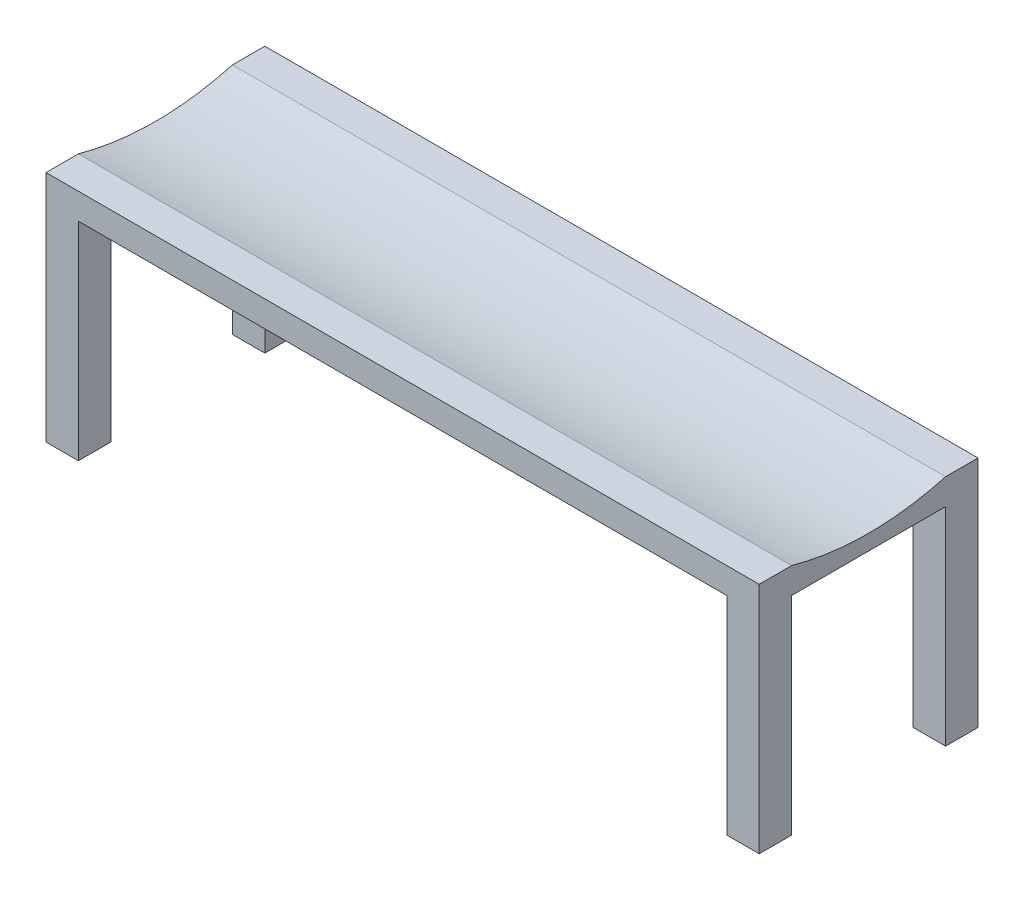
ISO-10303-21;
HEADER;
FILE_DESCRIPTION(('STEP AP214'),'2;1');
FILE_NAME('part.step','',(''),(''),'','','');
FILE_SCHEMA(('AUTOMOTIVE_DESIGN { 1 0 10303 214 1 1 1 1 }'));
ENDSEC;
DATA;
#1=APPLICATION_CONTEXT('core data for automotive mechanical design processes');
#2=APPLICATION_PROTOCOL_DEFINITION('international standard','automotive_design',2000,#1);
#3=PRODUCT_CONTEXT('',#1,'mechanical');
#4=PRODUCT('Part','Part','',(#3));
#5=PRODUCT_RELATED_PRODUCT_CATEGORY('part','',(#4));
#6=PRODUCT_DEFINITION_FORMATION('','',#4);
#7=PRODUCT_DEFINITION_CONTEXT('part definition',#1,'design');
#8=PRODUCT_DEFINITION('design','',#6,#7);
#9=PRODUCT_DEFINITION_SHAPE('','',#8);
#10=(LENGTH_UNIT() NAMED_UNIT(*) SI_UNIT(.MILLI.,.METRE.));
#11=(NAMED_UNIT(*) PLANE_ANGLE_UNIT() SI_UNIT($,.RADIAN.));
#12=(NAMED_UNIT(*) SI_UNIT($,.STERADIAN.) SOLID_ANGLE_UNIT());
#13=UNCERTAINTY_MEASURE_WITH_UNIT(LENGTH_MEASURE(1.E-05),#10,'distance_accuracy_value','');
#14=(GEOMETRIC_REPRESENTATION_CONTEXT(3) GLOBAL_UNCERTAINTY_ASSIGNED_CONTEXT((#13)) GLOBAL_UNIT_ASSIGNED_CONTEXT((#10,
#11,#12)) REPRESENTATION_CONTEXT('',''));
#15=CARTESIAN_POINT('',(0.,0.,0.));
#16=DIRECTION('',(0.,0.,1.));
#17=DIRECTION('',(1.,0.,0.));
#18=AXIS2_PLACEMENT_3D('',#15,#16,#17);
#19=CARTESIAN_POINT('',(162.387965446348,45.72,-6.86400747031921));
#20=DIRECTION('',(-1.,0.,0.));
#21=DIRECTION('',(0.,0.,1.));
#22=AXIS2_PLACEMENT_3D('',#19,#20,#21);
#23=PLANE('',#22);
#24=CARTESIAN_POINT('',(162.387965446348,45.72,-43.3765074703192));
#25=CARTESIAN_POINT('',(162.387965446348,41.5809779899401,-28.2952574703192));
#26=CARTESIAN_POINT('',(162.387965446348,45.72,-13.2140074703192));
#27=B_SPLINE_CURVE_WITH_KNOTS('',2,(#24,#25,#26),.UNSPECIFIED.,.F.,.F.,(3,3),(0.,1.),.UNSPECIFIED.);
#28=CARTESIAN_POINT('',(162.387965446348,45.72,-13.2140074703192));
#29=VERTEX_POINT('',#28);
#30=CARTESIAN_POINT('',(162.387965446348,45.72,-43.3765074703192));
#31=VERTEX_POINT('',#30);
#32=EDGE_CURVE('E53',#29,#31,#27,.F.);
#33=ORIENTED_EDGE('',*,*,#32,.F.);
#34=DIRECTION('',(0.,0.,-1.));
#35=VECTOR('',#34,1.);
#36=CARTESIAN_POINT('',(162.387965446348,45.72,-6.86400747031921));
#37=LINE('',#36,#35);
#38=CARTESIAN_POINT('',(162.387965446348,45.72,-6.86400747031921));
#39=VERTEX_POINT('',#38);
#40=EDGE_CURVE('E191',#39,#29,#37,.T.);
#41=ORIENTED_EDGE('',*,*,#40,.F.);
#42=DIRECTION('',(0.,-1.,0.));
#43=VECTOR('',#42,1.);
#44=CARTESIAN_POINT('',(162.387965446348,45.72,-6.86400747031921));
#45=LINE('',#44,#43);
#46=CARTESIAN_POINT('',(162.387965446348,0.,-6.86400747031921));
#47=VERTEX_POINT('',#46);
#48=EDGE_CURVE('E46',#39,#47,#45,.T.);
#49=ORIENTED_EDGE('',*,*,#48,.T.);
#50=DIRECTION('',(0.,0.,-1.));
#51=VECTOR('',#50,1.);
#52=CARTESIAN_POINT('',(162.387965446348,0.,-6.86400747031921));
#53=LINE('',#52,#51);
#54=CARTESIAN_POINT('',(162.387965446348,0.,-13.2140074703192));
#55=VERTEX_POINT('',#54);
#56=EDGE_CURVE('E205',#47,#55,#53,.T.);
#57=ORIENTED_EDGE('',*,*,#56,.T.);
#58=DIRECTION('',(0.,-1.,0.));
#59=VECTOR('',#58,1.);
#60=CARTESIAN_POINT('',(162.387965446348,40.64,-13.2140074703192));
#61=LINE('',#60,#59);
#62=CARTESIAN_POINT('',(162.387965446348,40.64,-13.2140074703192));
#63=VERTEX_POINT('',#62);
#64=EDGE_CURVE('E259',#63,#55,#61,.T.);
#65=ORIENTED_EDGE('',*,*,#64,.F.);
#66=DIRECTION('',(0.,0.,-1.));
#67=VECTOR('',#66,1.);
#68=CARTESIAN_POINT('',(162.387965446348,40.64,0.));
#69=LINE('',#68,#67);
#70=CARTESIAN_POINT('',(162.387965446348,40.64,-43.3765074703192));
#71=VERTEX_POINT('',#70);
#72=EDGE_CURVE('E393',#63,#71,#69,.T.);
#73=ORIENTED_EDGE('',*,*,#72,.T.);
#74=DIRECTION('',(0.,-1.,0.));
#75=VECTOR('',#74,1.);
#76=CARTESIAN_POINT('',(162.387965446348,40.64,-43.3765074703192));
#77=LINE('',#76,#75);
#78=CARTESIAN_POINT('',(162.387965446348,0.,-43.3765074703192));
#79=VERTEX_POINT('',#78);
#80=EDGE_CURVE('E256',#71,#79,#77,.T.);
#81=ORIENTED_EDGE('',*,*,#80,.T.);
#82=CARTESIAN_POINT('',(162.387965446348,0.,-49.7265074703192));
#83=VERTEX_POINT('',#82);
#84=EDGE_CURVE('E204',#79,#83,#53,.T.);
#85=ORIENTED_EDGE('',*,*,#84,.T.);
#86=DIRECTION('',(0.,-1.,0.));
#87=VECTOR('',#86,1.);
#88=CARTESIAN_POINT('',(162.387965446348,45.72,-49.7265074703192));
#89=LINE('',#88,#87);
#90=CARTESIAN_POINT('',(162.387965446348,45.72,-49.7265074703192));
#91=VERTEX_POINT('',#90);
#92=EDGE_CURVE('E212',#91,#83,#89,.T.);
#93=ORIENTED_EDGE('',*,*,#92,.F.);
#94=EDGE_CURVE('E184',#31,#91,#37,.T.);
#95=ORIENTED_EDGE('',*,*,#94,.F.);
#96=EDGE_LOOP('',(#33,#41,#49,#57,#65,#73,#81,#85,#93,#95));
#97=FACE_BOUND('',#96,.T.);
#98=ADVANCED_FACE('F38',(#97),#23,.F.);
#99=CARTESIAN_POINT('',(0.,45.72,0.));
#100=DIRECTION('',(0.,-1.,0.));
#101=DIRECTION('',(0.,0.,-1.));
#102=AXIS2_PLACEMENT_3D('',#99,#100,#101);
#103=PLANE('',#102);
#104=DIRECTION('',(1.,0.,0.));
#105=VECTOR('',#104,1.);
#106=CARTESIAN_POINT('',(-343.328331648153,45.72,-13.2140074703192));
#107=LINE('',#106,#105);
#108=CARTESIAN_POINT('',(22.6879654463481,45.72,-13.2140074703192));
#109=VERTEX_POINT('',#108);
#110=EDGE_CURVE('E168',#109,#29,#107,.T.);
#111=ORIENTED_EDGE('',*,*,#110,.F.);
#112=DIRECTION('',(0.,0.,1.));
#113=VECTOR('',#112,1.);
#114=CARTESIAN_POINT('',(22.6879654463481,45.72,-6.86400747031921));
#115=LINE('',#114,#113);
#116=CARTESIAN_POINT('',(22.6879654463481,45.72,-6.86400747031921));
#117=VERTEX_POINT('',#116);
#118=EDGE_CURVE('E176',#109,#117,#115,.T.);
#119=ORIENTED_EDGE('',*,*,#118,.T.);
#120=DIRECTION('',(1.,0.,0.));
#121=VECTOR('',#120,1.);
#122=CARTESIAN_POINT('',(22.6879654463481,45.72,-6.86400747031921));
#123=LINE('',#122,#121);
#124=EDGE_CURVE('E182',#117,#39,#123,.T.);
#125=ORIENTED_EDGE('',*,*,#124,.T.);
#126=ORIENTED_EDGE('',*,*,#40,.T.);
#127=EDGE_LOOP('',(#111,#119,#125,#126));
#128=FACE_BOUND('',#127,.T.);
#129=ADVANCED_FACE('F284',(#128),#103,.F.);
#130=CARTESIAN_POINT('',(22.6879654463481,45.72,-49.7265074703192));
#131=DIRECTION('',(0.,0.,1.));
#132=DIRECTION('',(1.,0.,0.));
#133=AXIS2_PLACEMENT_3D('',#130,#131,#132);
#134=PLANE('',#133);
#135=DIRECTION('',(0.,-1.,0.));
#136=VECTOR('',#135,1.);
#137=CARTESIAN_POINT('',(156.037965446348,40.64,-49.7265074703192));
#138=LINE('',#137,#136);
#139=CARTESIAN_POINT('',(156.037965446348,40.64,-49.7265074703192));
#140=VERTEX_POINT('',#139);
#141=CARTESIAN_POINT('',(156.037965446348,0.,-49.7265074703192));
#142=VERTEX_POINT('',#141);
#143=EDGE_CURVE('E252',#140,#142,#138,.T.);
#144=ORIENTED_EDGE('',*,*,#143,.F.);
#145=DIRECTION('',(-1.,0.,0.));
#146=VECTOR('',#145,1.);
#147=CARTESIAN_POINT('',(0.,40.64,-49.7265074703192));
#148=LINE('',#147,#146);
#149=CARTESIAN_POINT('',(29.0379654463481,40.64,-49.7265074703192));
#150=VERTEX_POINT('',#149);
#151=EDGE_CURVE('E398',#140,#150,#148,.T.);
#152=ORIENTED_EDGE('',*,*,#151,.T.);
#153=DIRECTION('',(0.,-1.,0.));
#154=VECTOR('',#153,1.);
#155=CARTESIAN_POINT('',(29.0379654463481,40.64,-49.7265074703192));
#156=LINE('',#155,#154);
#157=CARTESIAN_POINT('',(29.0379654463481,0.,-49.7265074703192));
#158=VERTEX_POINT('',#157);
#159=EDGE_CURVE('E248',#150,#158,#156,.T.);
#160=ORIENTED_EDGE('',*,*,#159,.T.);
#161=DIRECTION('',(-1.,0.,0.));
#162=VECTOR('',#161,1.);
#163=CARTESIAN_POINT('',(22.6879654463481,0.,-49.7265074703192));
#164=LINE('',#163,#162);
#165=CARTESIAN_POINT('',(22.6879654463481,0.,-49.7265074703192));
#166=VERTEX_POINT('',#165);
#167=EDGE_CURVE('E208',#158,#166,#164,.T.);
#168=ORIENTED_EDGE('',*,*,#167,.T.);
#169=DIRECTION('',(0.,-1.,0.));
#170=VECTOR('',#169,1.);
#171=CARTESIAN_POINT('',(22.6879654463481,45.72,-49.7265074703192));
#172=LINE('',#171,#170);
#173=CARTESIAN_POINT('',(22.6879654463481,45.72,-49.7265074703192));
#174=VERTEX_POINT('',#173);
#175=EDGE_CURVE('E195',#174,#166,#172,.T.);
#176=ORIENTED_EDGE('',*,*,#175,.F.);
#177=DIRECTION('',(-1.,0.,0.));
#178=VECTOR('',#177,1.);
#179=CARTESIAN_POINT('',(22.6879654463481,45.72,-49.7265074703192));
#180=LINE('',#179,#178);
#181=EDGE_CURVE('E180',#91,#174,#180,.T.);
#182=ORIENTED_EDGE('',*,*,#181,.F.);
#183=ORIENTED_EDGE('',*,*,#92,.T.);
#184=EDGE_CURVE('E186',#83,#142,#164,.T.);
#185=ORIENTED_EDGE('',*,*,#184,.T.);
#186=EDGE_LOOP('',(#144,#152,#160,#168,#176,#182,#183,#185));
#187=FACE_BOUND('',#186,.T.);
#188=ADVANCED_FACE('F341',(#187),#134,.F.);
#189=CARTESIAN_POINT('',(0.,0.,0.));
#190=DIRECTION('',(0.,-1.,0.));
#191=DIRECTION('',(0.,0.,-1.));
#192=AXIS2_PLACEMENT_3D('',#189,#190,#191);
#193=PLANE('',#192);
#194=DIRECTION('',(1.,0.,0.));
#195=VECTOR('',#194,1.);
#196=CARTESIAN_POINT('',(22.6879654463481,0.,-6.86400747031921));
#197=LINE('',#196,#195);
#198=CARTESIAN_POINT('',(156.037965446348,0.,-6.86400747031921));
#199=VERTEX_POINT('',#198);
#200=EDGE_CURVE('E199',#199,#47,#197,.T.);
#201=ORIENTED_EDGE('',*,*,#200,.F.);
#202=DIRECTION('',(0.,0.,-1.));
#203=VECTOR('',#202,1.);
#204=CARTESIAN_POINT('',(156.037965446348,0.,0.));
#205=LINE('',#204,#203);
#206=CARTESIAN_POINT('',(156.037965446348,0.,-13.2140074703192));
#207=VERTEX_POINT('',#206);
#208=EDGE_CURVE('E229',#199,#207,#205,.T.);
#209=ORIENTED_EDGE('',*,*,#208,.T.);
#210=DIRECTION('',(1.,0.,0.));
#211=VECTOR('',#210,1.);
#212=CARTESIAN_POINT('',(0.,0.,-13.2140074703192));
#213=LINE('',#212,#211);
#214=EDGE_CURVE('E228',#207,#55,#213,.T.);
#215=ORIENTED_EDGE('',*,*,#214,.T.);
#216=ORIENTED_EDGE('',*,*,#56,.F.);
#217=EDGE_LOOP('',(#201,#209,#215,#216));
#218=FACE_BOUND('',#217,.T.);
#219=ADVANCED_FACE('F225',(#218),#193,.T.);
#220=ORIENTED_EDGE('',*,*,#84,.F.);
#221=DIRECTION('',(-1.,0.,0.));
#222=VECTOR('',#221,1.);
#223=CARTESIAN_POINT('',(0.,0.,-43.3765074703192));
#224=LINE('',#223,#222);
#225=CARTESIAN_POINT('',(156.037965446348,0.,-43.3765074703192));
#226=VERTEX_POINT('',#225);
#227=EDGE_CURVE('E232',#79,#226,#224,.T.);
#228=ORIENTED_EDGE('',*,*,#227,.T.);
#229=DIRECTION('',(0.,0.,-1.));
#230=VECTOR('',#229,1.);
#231=CARTESIAN_POINT('',(156.037965446348,0.,0.));
#232=LINE('',#231,#230);
#233=EDGE_CURVE('E235',#226,#142,#232,.T.);
#234=ORIENTED_EDGE('',*,*,#233,.T.);
#235=ORIENTED_EDGE('',*,*,#184,.F.);
#236=EDGE_LOOP('',(#220,#228,#234,#235));
#237=FACE_BOUND('',#236,.T.);
#238=ADVANCED_FACE('F353',(#237),#193,.T.);
#239=DIRECTION('',(-1.,0.,0.));
#240=VECTOR('',#239,1.);
#241=CARTESIAN_POINT('',(0.,0.,-13.2140074703192));
#242=LINE('',#241,#240);
#243=CARTESIAN_POINT('',(29.0379654463481,0.,-13.2140074703192));
#244=VERTEX_POINT('',#243);
#245=CARTESIAN_POINT('',(22.6879654463481,0.,-13.2140074703192));
#246=VERTEX_POINT('',#245);
#247=EDGE_CURVE('E369',#244,#246,#242,.T.);
#248=ORIENTED_EDGE('',*,*,#247,.F.);
#249=DIRECTION('',(0.,0.,-1.));
#250=VECTOR('',#249,1.);
#251=CARTESIAN_POINT('',(29.0379654463481,0.,0.));
#252=LINE('',#251,#250);
#253=CARTESIAN_POINT('',(29.0379654463481,0.,-6.86400747031921));
#254=VERTEX_POINT('',#253);
#255=EDGE_CURVE('E237',#254,#244,#252,.T.);
#256=ORIENTED_EDGE('',*,*,#255,.F.);
#257=CARTESIAN_POINT('',(22.6879654463481,0.,-6.86400747031921));
#258=VERTEX_POINT('',#257);
#259=EDGE_CURVE('E201',#258,#254,#197,.T.);
#260=ORIENTED_EDGE('',*,*,#259,.F.);
#261=DIRECTION('',(0.,0.,1.));
#262=VECTOR('',#261,1.);
#263=CARTESIAN_POINT('',(22.6879654463481,0.,-6.86400747031921));
#264=LINE('',#263,#262);
#265=EDGE_CURVE('E200',#246,#258,#264,.T.);
#266=ORIENTED_EDGE('',*,*,#265,.F.);
#267=EDGE_LOOP('',(#248,#256,#260,#266));
#268=FACE_BOUND('',#267,.T.);
#269=ADVANCED_FACE('F279',(#268),#193,.T.);
#270=CARTESIAN_POINT('',(22.6879654463481,45.72,-6.86400747031921));
#271=DIRECTION('',(1.,0.,0.));
#272=DIRECTION('',(0.,0.,-1.));
#273=AXIS2_PLACEMENT_3D('',#270,#271,#272);
#274=PLANE('',#273);
#275=ORIENTED_EDGE('',*,*,#118,.F.);
#276=CARTESIAN_POINT('',(22.6879654463481,45.72,-43.3765074703192));
#277=CARTESIAN_POINT('',(22.6879654463481,41.5809779899401,-28.2952574703192));
#278=CARTESIAN_POINT('',(22.6879654463481,45.72,-13.2140074703192));
#279=B_SPLINE_CURVE_WITH_KNOTS('',2,(#276,#277,#278),.UNSPECIFIED.,.F.,.F.,(3,3),(0.,1.),.UNSPECIFIED.);
#280=CARTESIAN_POINT('',(22.6879654463481,45.72,-43.3765074703192));
#281=VERTEX_POINT('',#280);
#282=EDGE_CURVE('E163',#109,#281,#279,.F.);
#283=ORIENTED_EDGE('',*,*,#282,.T.);
#284=EDGE_CURVE('E174',#174,#281,#115,.T.);
#285=ORIENTED_EDGE('',*,*,#284,.F.);
#286=ORIENTED_EDGE('',*,*,#175,.T.);
#287=CARTESIAN_POINT('',(22.6879654463481,0.,-43.3765074703192));
#288=VERTEX_POINT('',#287);
#289=EDGE_CURVE('E196',#166,#288,#264,.T.);
#290=ORIENTED_EDGE('',*,*,#289,.T.);
#291=DIRECTION('',(0.,-1.,0.));
#292=VECTOR('',#291,1.);
#293=CARTESIAN_POINT('',(22.6879654463481,40.64,-43.3765074703192));
#294=LINE('',#293,#292);
#295=CARTESIAN_POINT('',(22.6879654463481,40.64,-43.3765074703192));
#296=VERTEX_POINT('',#295);
#297=EDGE_CURVE('E188',#296,#288,#294,.T.);
#298=ORIENTED_EDGE('',*,*,#297,.F.);
#299=DIRECTION('',(0.,0.,1.));
#300=VECTOR('',#299,1.);
#301=CARTESIAN_POINT('',(22.6879654463481,40.64,0.));
#302=LINE('',#301,#300);
#303=CARTESIAN_POINT('',(22.6879654463481,40.64,-13.2140074703192));
#304=VERTEX_POINT('',#303);
#305=EDGE_CURVE('E380',#296,#304,#302,.T.);
#306=ORIENTED_EDGE('',*,*,#305,.T.);
#307=DIRECTION('',(0.,-1.,0.));
#308=VECTOR('',#307,1.);
#309=CARTESIAN_POINT('',(22.6879654463481,40.64,-13.2140074703192));
#310=LINE('',#309,#308);
#311=EDGE_CURVE('E269',#304,#246,#310,.T.);
#312=ORIENTED_EDGE('',*,*,#311,.T.);
#313=ORIENTED_EDGE('',*,*,#265,.T.);
#314=DIRECTION('',(0.,-1.,0.));
#315=VECTOR('',#314,1.);
#316=CARTESIAN_POINT('',(22.6879654463481,45.72,-6.86400747031921));
#317=LINE('',#316,#315);
#318=EDGE_CURVE('E11',#117,#258,#317,.T.);
#319=ORIENTED_EDGE('',*,*,#318,.F.);
#320=EDGE_LOOP('',(#275,#283,#285,#286,#290,#298,#306,#312,#313,#319));
#321=FACE_BOUND('',#320,.T.);
#322=ADVANCED_FACE('F40',(#321),#274,.F.);
#323=CARTESIAN_POINT('',(22.6879654463481,45.72,-6.86400747031921));
#324=DIRECTION('',(0.,0.,-1.));
#325=DIRECTION('',(-1.,0.,0.));
#326=AXIS2_PLACEMENT_3D('',#323,#324,#325);
#327=PLANE('',#326);
#328=ORIENTED_EDGE('',*,*,#259,.T.);
#329=DIRECTION('',(0.,-1.,0.));
#330=VECTOR('',#329,1.);
#331=CARTESIAN_POINT('',(29.0379654463481,40.64,-6.86400747031921));
#332=LINE('',#331,#330);
#333=CARTESIAN_POINT('',(29.0379654463481,40.64,-6.86400747031921));
#334=VERTEX_POINT('',#333);
#335=EDGE_CURVE('E266',#334,#254,#332,.T.);
#336=ORIENTED_EDGE('',*,*,#335,.F.);
#337=DIRECTION('',(1.,0.,0.));
#338=VECTOR('',#337,1.);
#339=CARTESIAN_POINT('',(0.,40.64,-6.86400747031921));
#340=LINE('',#339,#338);
#341=CARTESIAN_POINT('',(156.037965446348,40.64,-6.86400747031921));
#342=VERTEX_POINT('',#341);
#343=EDGE_CURVE('E385',#334,#342,#340,.T.);
#344=ORIENTED_EDGE('',*,*,#343,.T.);
#345=DIRECTION('',(0.,-1.,0.));
#346=VECTOR('',#345,1.);
#347=CARTESIAN_POINT('',(156.037965446348,40.64,-6.86400747031921));
#348=LINE('',#347,#346);
#349=EDGE_CURVE('E263',#342,#199,#348,.T.);
#350=ORIENTED_EDGE('',*,*,#349,.T.);
#351=ORIENTED_EDGE('',*,*,#200,.T.);
#352=ORIENTED_EDGE('',*,*,#48,.F.);
#353=ORIENTED_EDGE('',*,*,#124,.F.);
#354=ORIENTED_EDGE('',*,*,#318,.T.);
#355=EDGE_LOOP('',(#328,#336,#344,#350,#351,#352,#353,#354));
#356=FACE_BOUND('',#355,.T.);
#357=ADVANCED_FACE('F282',(#356),#327,.F.);
#358=ORIENTED_EDGE('',*,*,#284,.T.);
#359=DIRECTION('',(1.,0.,0.));
#360=VECTOR('',#359,1.);
#361=CARTESIAN_POINT('',(-343.328331648153,45.72,-43.3765074703192));
#362=LINE('',#361,#360);
#363=EDGE_CURVE('E160',#281,#31,#362,.T.);
#364=ORIENTED_EDGE('',*,*,#363,.T.);
#365=ORIENTED_EDGE('',*,*,#94,.T.);
#366=ORIENTED_EDGE('',*,*,#181,.T.);
#367=EDGE_LOOP('',(#358,#364,#365,#366));
#368=FACE_BOUND('',#367,.T.);
#369=ADVANCED_FACE('F178',(#368),#103,.F.);
#370=DIRECTION('',(1.,0.,0.));
#371=VECTOR('',#370,1.);
#372=CARTESIAN_POINT('',(0.,0.,-43.3765074703192));
#373=LINE('',#372,#371);
#374=CARTESIAN_POINT('',(29.0379654463481,0.,-43.3765074703192));
#375=VERTEX_POINT('',#374);
#376=EDGE_CURVE('E61',#288,#375,#373,.T.);
#377=ORIENTED_EDGE('',*,*,#376,.F.);
#378=ORIENTED_EDGE('',*,*,#289,.F.);
#379=ORIENTED_EDGE('',*,*,#167,.F.);
#380=DIRECTION('',(0.,0.,-1.));
#381=VECTOR('',#380,1.);
#382=CARTESIAN_POINT('',(29.0379654463481,0.,0.));
#383=LINE('',#382,#381);
#384=EDGE_CURVE('E243',#375,#158,#383,.T.);
#385=ORIENTED_EDGE('',*,*,#384,.F.);
#386=EDGE_LOOP('',(#377,#378,#379,#385));
#387=FACE_BOUND('',#386,.T.);
#388=ADVANCED_FACE('F335',(#387),#193,.T.);
#389=CARTESIAN_POINT('',(0.,40.64,-43.3765074703192));
#390=DIRECTION('',(0.,0.,-1.));
#391=DIRECTION('',(-1.,0.,0.));
#392=AXIS2_PLACEMENT_3D('',#389,#390,#391);
#393=PLANE('',#392);
#394=ORIENTED_EDGE('',*,*,#376,.T.);
#395=DIRECTION('',(0.,-1.,0.));
#396=VECTOR('',#395,1.);
#397=CARTESIAN_POINT('',(29.0379654463481,40.64,-43.3765074703192));
#398=LINE('',#397,#396);
#399=CARTESIAN_POINT('',(29.0379654463481,40.64,-43.3765074703192));
#400=VERTEX_POINT('',#399);
#401=EDGE_CURVE('E246',#400,#375,#398,.T.);
#402=ORIENTED_EDGE('',*,*,#401,.F.);
#403=DIRECTION('',(1.,0.,0.));
#404=VECTOR('',#403,1.);
#405=CARTESIAN_POINT('',(0.,40.64,-43.3765074703192));
#406=LINE('',#405,#404);
#407=EDGE_CURVE('E245',#296,#400,#406,.T.);
#408=ORIENTED_EDGE('',*,*,#407,.F.);
#409=ORIENTED_EDGE('',*,*,#297,.T.);
#410=EDGE_LOOP('',(#394,#402,#408,#409));
#411=FACE_BOUND('',#410,.T.);
#412=ADVANCED_FACE('F331',(#411),#393,.F.);
#413=CARTESIAN_POINT('',(0.,40.64,-13.2140074703192));
#414=DIRECTION('',(0.,0.,1.));
#415=DIRECTION('',(1.,0.,0.));
#416=AXIS2_PLACEMENT_3D('',#413,#414,#415);
#417=PLANE('',#416);
#418=ORIENTED_EDGE('',*,*,#247,.T.);
#419=ORIENTED_EDGE('',*,*,#311,.F.);
#420=DIRECTION('',(-1.,0.,0.));
#421=VECTOR('',#420,1.);
#422=CARTESIAN_POINT('',(0.,40.64,-13.2140074703192));
#423=LINE('',#422,#421);
#424=CARTESIAN_POINT('',(29.0379654463481,40.64,-13.2140074703192));
#425=VERTEX_POINT('',#424);
#426=EDGE_CURVE('E377',#425,#304,#423,.T.);
#427=ORIENTED_EDGE('',*,*,#426,.F.);
#428=DIRECTION('',(0.,-1.,0.));
#429=VECTOR('',#428,1.);
#430=CARTESIAN_POINT('',(29.0379654463481,40.64,-13.2140074703192));
#431=LINE('',#430,#429);
#432=EDGE_CURVE('E268',#425,#244,#431,.T.);
#433=ORIENTED_EDGE('',*,*,#432,.T.);
#434=EDGE_LOOP('',(#418,#419,#427,#433));
#435=FACE_BOUND('',#434,.T.);
#436=ADVANCED_FACE('F327',(#435),#417,.F.);
#437=CARTESIAN_POINT('',(29.0379654463481,40.64,0.));
#438=DIRECTION('',(-1.,0.,0.));
#439=DIRECTION('',(0.,0.,1.));
#440=AXIS2_PLACEMENT_3D('',#437,#438,#439);
#441=PLANE('',#440);
#442=ORIENTED_EDGE('',*,*,#255,.T.);
#443=ORIENTED_EDGE('',*,*,#432,.F.);
#444=DIRECTION('',(0.,0.,-1.));
#445=VECTOR('',#444,1.);
#446=CARTESIAN_POINT('',(29.0379654463481,40.64,0.));
#447=LINE('',#446,#445);
#448=EDGE_CURVE('E379',#334,#425,#447,.T.);
#449=ORIENTED_EDGE('',*,*,#448,.F.);
#450=ORIENTED_EDGE('',*,*,#335,.T.);
#451=EDGE_LOOP('',(#442,#443,#449,#450));
#452=FACE_BOUND('',#451,.T.);
#453=ADVANCED_FACE('F323',(#452),#441,.F.);
#454=CARTESIAN_POINT('',(156.037965446348,40.64,0.));
#455=DIRECTION('',(-1.,0.,0.));
#456=DIRECTION('',(0.,0.,1.));
#457=AXIS2_PLACEMENT_3D('',#454,#455,#456);
#458=PLANE('',#457);
#459=ORIENTED_EDGE('',*,*,#208,.F.);
#460=ORIENTED_EDGE('',*,*,#349,.F.);
#461=DIRECTION('',(0.,0.,-1.));
#462=VECTOR('',#461,1.);
#463=CARTESIAN_POINT('',(156.037965446348,40.64,0.));
#464=LINE('',#463,#462);
#465=CARTESIAN_POINT('',(156.037965446348,40.64,-13.2140074703192));
#466=VERTEX_POINT('',#465);
#467=EDGE_CURVE('E387',#342,#466,#464,.T.);
#468=ORIENTED_EDGE('',*,*,#467,.T.);
#469=DIRECTION('',(0.,-1.,0.));
#470=VECTOR('',#469,1.);
#471=CARTESIAN_POINT('',(156.037965446348,40.64,-13.2140074703192));
#472=LINE('',#471,#470);
#473=EDGE_CURVE('E261',#466,#207,#472,.T.);
#474=ORIENTED_EDGE('',*,*,#473,.T.);
#475=EDGE_LOOP('',(#459,#460,#468,#474));
#476=FACE_BOUND('',#475,.T.);
#477=ADVANCED_FACE('F320',(#476),#458,.T.);
#478=CARTESIAN_POINT('',(0.,40.64,-13.2140074703192));
#479=DIRECTION('',(0.,0.,-1.));
#480=DIRECTION('',(-1.,0.,0.));
#481=AXIS2_PLACEMENT_3D('',#478,#479,#480);
#482=PLANE('',#481);
#483=ORIENTED_EDGE('',*,*,#214,.F.);
#484=ORIENTED_EDGE('',*,*,#473,.F.);
#485=DIRECTION('',(1.,0.,0.));
#486=VECTOR('',#485,1.);
#487=CARTESIAN_POINT('',(0.,40.64,-13.2140074703192));
#488=LINE('',#487,#486);
#489=EDGE_CURVE('E391',#466,#63,#488,.T.);
#490=ORIENTED_EDGE('',*,*,#489,.T.);
#491=ORIENTED_EDGE('',*,*,#64,.T.);
#492=EDGE_LOOP('',(#483,#484,#490,#491));
#493=FACE_BOUND('',#492,.T.);
#494=ADVANCED_FACE('F316',(#493),#482,.T.);
#495=CARTESIAN_POINT('',(0.,40.64,-43.3765074703192));
#496=DIRECTION('',(0.,0.,1.));
#497=DIRECTION('',(1.,0.,0.));
#498=AXIS2_PLACEMENT_3D('',#495,#496,#497);
#499=PLANE('',#498);
#500=ORIENTED_EDGE('',*,*,#227,.F.);
#501=ORIENTED_EDGE('',*,*,#80,.F.);
#502=DIRECTION('',(-1.,0.,0.));
#503=VECTOR('',#502,1.);
#504=CARTESIAN_POINT('',(0.,40.64,-43.3765074703192));
#505=LINE('',#504,#503);
#506=CARTESIAN_POINT('',(156.037965446348,40.64,-43.3765074703192));
#507=VERTEX_POINT('',#506);
#508=EDGE_CURVE('E395',#71,#507,#505,.T.);
#509=ORIENTED_EDGE('',*,*,#508,.T.);
#510=DIRECTION('',(0.,-1.,0.));
#511=VECTOR('',#510,1.);
#512=CARTESIAN_POINT('',(156.037965446348,40.64,-43.3765074703192));
#513=LINE('',#512,#511);
#514=EDGE_CURVE('E254',#507,#226,#513,.T.);
#515=ORIENTED_EDGE('',*,*,#514,.T.);
#516=EDGE_LOOP('',(#500,#501,#509,#515));
#517=FACE_BOUND('',#516,.T.);
#518=ADVANCED_FACE('F312',(#517),#499,.T.);
#519=CARTESIAN_POINT('',(156.037965446348,40.64,0.));
#520=DIRECTION('',(-1.,0.,0.));
#521=DIRECTION('',(0.,0.,1.));
#522=AXIS2_PLACEMENT_3D('',#519,#520,#521);
#523=PLANE('',#522);
#524=ORIENTED_EDGE('',*,*,#233,.F.);
#525=ORIENTED_EDGE('',*,*,#514,.F.);
#526=DIRECTION('',(0.,0.,-1.));
#527=VECTOR('',#526,1.);
#528=CARTESIAN_POINT('',(156.037965446348,40.64,0.));
#529=LINE('',#528,#527);
#530=EDGE_CURVE('E397',#507,#140,#529,.T.);
#531=ORIENTED_EDGE('',*,*,#530,.T.);
#532=ORIENTED_EDGE('',*,*,#143,.T.);
#533=EDGE_LOOP('',(#524,#525,#531,#532));
#534=FACE_BOUND('',#533,.T.);
#535=ADVANCED_FACE('F308',(#534),#523,.T.);
#536=CARTESIAN_POINT('',(29.0379654463481,40.64,0.));
#537=DIRECTION('',(-1.,0.,0.));
#538=DIRECTION('',(0.,0.,1.));
#539=AXIS2_PLACEMENT_3D('',#536,#537,#538);
#540=PLANE('',#539);
#541=ORIENTED_EDGE('',*,*,#384,.T.);
#542=ORIENTED_EDGE('',*,*,#159,.F.);
#543=DIRECTION('',(0.,0.,-1.));
#544=VECTOR('',#543,1.);
#545=CARTESIAN_POINT('',(29.0379654463481,40.64,0.));
#546=LINE('',#545,#544);
#547=EDGE_CURVE('E249',#400,#150,#546,.T.);
#548=ORIENTED_EDGE('',*,*,#547,.F.);
#549=ORIENTED_EDGE('',*,*,#401,.T.);
#550=EDGE_LOOP('',(#541,#542,#548,#549));
#551=FACE_BOUND('',#550,.T.);
#552=ADVANCED_FACE('F304',(#551),#540,.F.);
#553=CARTESIAN_POINT('',(0.,40.64,0.));
#554=DIRECTION('',(0.,1.,0.));
#555=DIRECTION('',(0.,0.,1.));
#556=AXIS2_PLACEMENT_3D('',#553,#554,#555);
#557=PLANE('',#556);
#558=ORIENTED_EDGE('',*,*,#407,.T.);
#559=ORIENTED_EDGE('',*,*,#547,.T.);
#560=ORIENTED_EDGE('',*,*,#151,.F.);
#561=ORIENTED_EDGE('',*,*,#530,.F.);
#562=ORIENTED_EDGE('',*,*,#508,.F.);
#563=ORIENTED_EDGE('',*,*,#72,.F.);
#564=ORIENTED_EDGE('',*,*,#489,.F.);
#565=ORIENTED_EDGE('',*,*,#467,.F.);
#566=ORIENTED_EDGE('',*,*,#343,.F.);
#567=ORIENTED_EDGE('',*,*,#448,.T.);
#568=ORIENTED_EDGE('',*,*,#426,.T.);
#569=ORIENTED_EDGE('',*,*,#305,.F.);
#570=EDGE_LOOP('',(#558,#559,#560,#561,#562,#563,#564,#565,#566,#567,#568,#569));
#571=FACE_BOUND('',#570,.T.);
#572=ADVANCED_FACE('F301',(#571),#557,.F.);
#573=CARTESIAN_POINT('',(-343.328331648153,45.72,-43.3765074703192));
#574=CARTESIAN_POINT('',(-343.328331648153,41.5809779899401,-28.2952574703192));
#575=CARTESIAN_POINT('',(-343.328331648153,45.72,-13.2140074703192));
#576=B_SPLINE_CURVE_WITH_KNOTS('',2,(#573,#574,#575),.UNSPECIFIED.,.F.,.F.,(3,3),(0.,1.),.UNSPECIFIED.);
#577=DIRECTION('',(1.,0.,0.));
#578=VECTOR('',#577,1.);
#579=SURFACE_OF_LINEAR_EXTRUSION('',#576,#578);
#580=ORIENTED_EDGE('',*,*,#282,.F.);
#581=ORIENTED_EDGE('',*,*,#110,.T.);
#582=ORIENTED_EDGE('',*,*,#32,.T.);
#583=ORIENTED_EDGE('',*,*,#363,.F.);
#584=EDGE_LOOP('',(#580,#581,#582,#583));
#585=FACE_BOUND('',#584,.T.);
#586=ADVANCED_FACE('F162',(#585),#579,.T.);
#587=CLOSED_SHELL('',(#98,#129,#188,#219,#238,#269,#322,#357,#369,#388,#412,#436,#453,#477,#494,
#518,#535,#552,#572,#586));
#588=MANIFOLD_SOLID_BREP('B2',#587);
#589=ADVANCED_BREP_SHAPE_REPRESENTATION('',(#18,#588),#14);
#590=SHAPE_DEFINITION_REPRESENTATION(#9,#589);
ENDSEC;
END-ISO-10303-21;
